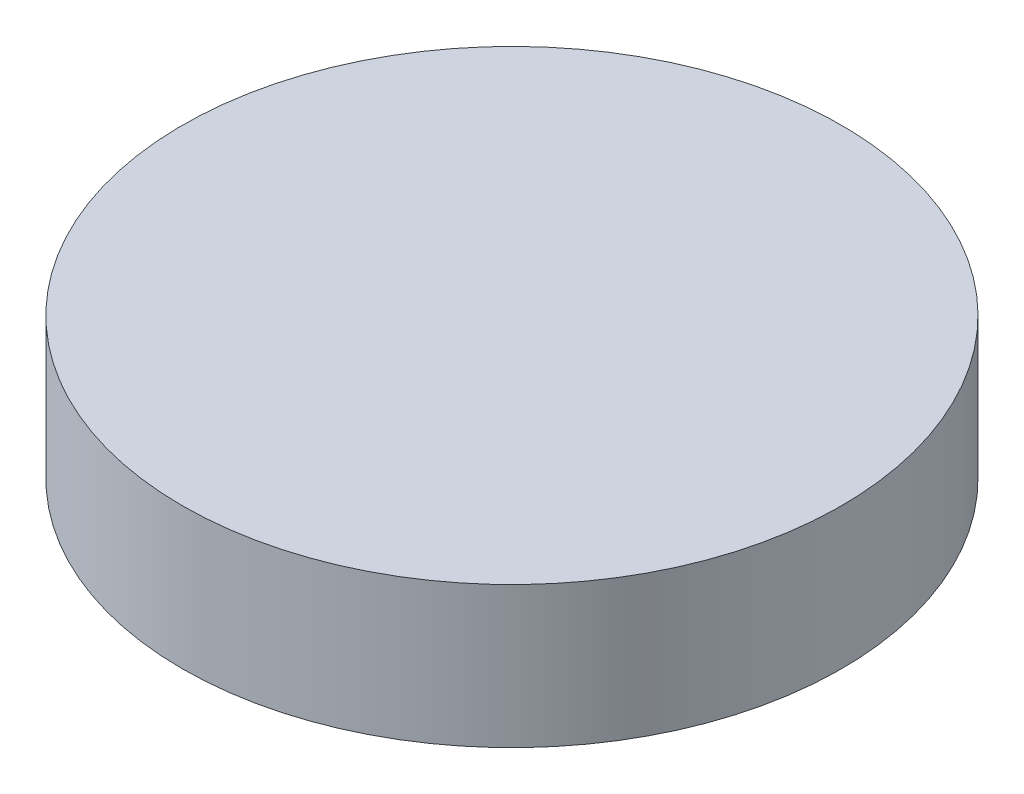
ISO-10303-21;
HEADER;
FILE_DESCRIPTION(('STEP AP214'),'2;1');
FILE_NAME('part.step','',(''),(''),'','','');
FILE_SCHEMA(('AUTOMOTIVE_DESIGN { 1 0 10303 214 1 1 1 1 }'));
ENDSEC;
DATA;
#1=APPLICATION_CONTEXT('core data for automotive mechanical design processes');
#2=APPLICATION_PROTOCOL_DEFINITION('international standard','automotive_design',2000,#1);
#3=PRODUCT_CONTEXT('',#1,'mechanical');
#4=PRODUCT('Part','Part','',(#3));
#5=PRODUCT_RELATED_PRODUCT_CATEGORY('part','',(#4));
#6=PRODUCT_DEFINITION_FORMATION('','',#4);
#7=PRODUCT_DEFINITION_CONTEXT('part definition',#1,'design');
#8=PRODUCT_DEFINITION('design','',#6,#7);
#9=PRODUCT_DEFINITION_SHAPE('','',#8);
#10=(LENGTH_UNIT() NAMED_UNIT(*) SI_UNIT(.MILLI.,.METRE.));
#11=(NAMED_UNIT(*) PLANE_ANGLE_UNIT() SI_UNIT($,.RADIAN.));
#12=(NAMED_UNIT(*) SI_UNIT($,.STERADIAN.) SOLID_ANGLE_UNIT());
#13=UNCERTAINTY_MEASURE_WITH_UNIT(LENGTH_MEASURE(1.E-05),#10,'distance_accuracy_value','');
#14=(GEOMETRIC_REPRESENTATION_CONTEXT(3) GLOBAL_UNCERTAINTY_ASSIGNED_CONTEXT((#13)) GLOBAL_UNIT_ASSIGNED_CONTEXT((#10,
#11,#12)) REPRESENTATION_CONTEXT('',''));
#15=CARTESIAN_POINT('',(0.,0.,0.));
#16=DIRECTION('',(0.,0.,1.));
#17=DIRECTION('',(1.,0.,0.));
#18=AXIS2_PLACEMENT_3D('',#15,#16,#17);
#19=CARTESIAN_POINT('',(0.,6.,0.));
#20=DIRECTION('',(0.,-1.,0.));
#21=DIRECTION('',(0.,0.,-1.));
#22=AXIS2_PLACEMENT_3D('',#19,#20,#21);
#23=CYLINDRICAL_SURFACE('',#22,14.);
#24=CARTESIAN_POINT('',(0.,6.,0.));
#25=DIRECTION('',(0.,1.,0.));
#26=DIRECTION('',(0.,0.,1.));
#27=AXIS2_PLACEMENT_3D('',#24,#25,#26);
#28=CIRCLE('',#27,14.);
#29=CARTESIAN_POINT('',(0.,6.,14.));
#30=VERTEX_POINT('',#29);
#31=EDGE_CURVE('E10',#30,#30,#28,.T.);
#32=ORIENTED_EDGE('',*,*,#31,.F.);
#33=EDGE_LOOP('',(#32));
#34=FACE_BOUND('',#33,.T.);
#35=CARTESIAN_POINT('',(0.,0.,0.));
#36=DIRECTION('',(0.,1.,0.));
#37=DIRECTION('',(0.,0.,1.));
#38=AXIS2_PLACEMENT_3D('',#35,#36,#37);
#39=CIRCLE('',#38,14.);
#40=CARTESIAN_POINT('',(0.,0.,14.));
#41=VERTEX_POINT('',#40);
#42=EDGE_CURVE('E37',#41,#41,#39,.T.);
#43=ORIENTED_EDGE('',*,*,#42,.T.);
#44=EDGE_LOOP('',(#43));
#45=FACE_BOUND('',#44,.T.);
#46=ADVANCED_FACE('F34',(#34,#45),#23,.T.);
#47=CARTESIAN_POINT('',(0.,6.,0.));
#48=DIRECTION('',(0.,1.,0.));
#49=DIRECTION('',(0.,0.,1.));
#50=AXIS2_PLACEMENT_3D('',#47,#48,#49);
#51=PLANE('',#50);
#52=ORIENTED_EDGE('',*,*,#31,.T.);
#53=EDGE_LOOP('',(#52));
#54=FACE_BOUND('',#53,.T.);
#55=ADVANCED_FACE('F49',(#54),#51,.T.);
#56=CARTESIAN_POINT('',(0.,0.,0.));
#57=DIRECTION('',(0.,1.,0.));
#58=DIRECTION('',(0.,0.,1.));
#59=AXIS2_PLACEMENT_3D('',#56,#57,#58);
#60=PLANE('',#59);
#61=ORIENTED_EDGE('',*,*,#42,.F.);
#62=EDGE_LOOP('',(#61));
#63=FACE_BOUND('',#62,.T.);
#64=ADVANCED_FACE('F47',(#63),#60,.F.);
#65=CLOSED_SHELL('',(#46,#55,#64));
#66=MANIFOLD_SOLID_BREP('B2',#65);
#67=ADVANCED_BREP_SHAPE_REPRESENTATION('',(#18,#66),#14);
#68=SHAPE_DEFINITION_REPRESENTATION(#9,#67);
ENDSEC;
END-ISO-10303-21;
